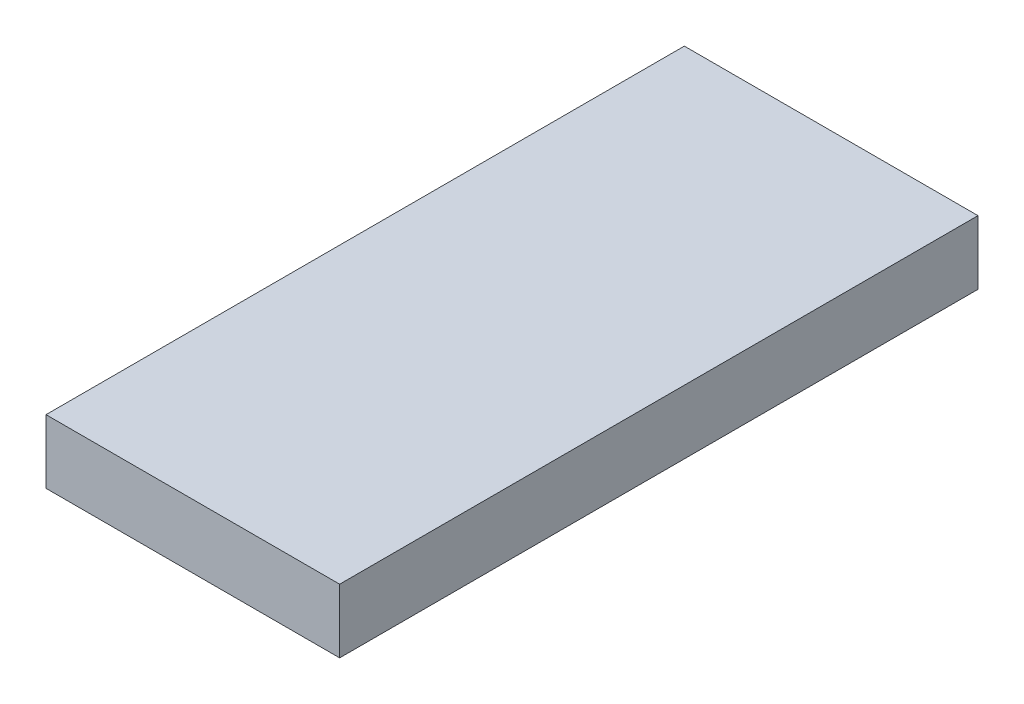
ISO-10303-21;
HEADER;
FILE_DESCRIPTION(('STEP AP214'),'2;1');
FILE_NAME('part.step','',(''),(''),'','','');
FILE_SCHEMA(('AUTOMOTIVE_DESIGN { 1 0 10303 214 1 1 1 1 }'));
ENDSEC;
DATA;
#1=APPLICATION_CONTEXT('core data for automotive mechanical design processes');
#2=APPLICATION_PROTOCOL_DEFINITION('international standard','automotive_design',2000,#1);
#3=PRODUCT_CONTEXT('',#1,'mechanical');
#4=PRODUCT('Part','Part','',(#3));
#5=PRODUCT_RELATED_PRODUCT_CATEGORY('part','',(#4));
#6=PRODUCT_DEFINITION_FORMATION('','',#4);
#7=PRODUCT_DEFINITION_CONTEXT('part definition',#1,'design');
#8=PRODUCT_DEFINITION('design','',#6,#7);
#9=PRODUCT_DEFINITION_SHAPE('','',#8);
#10=(LENGTH_UNIT() NAMED_UNIT(*) SI_UNIT(.MILLI.,.METRE.));
#11=(NAMED_UNIT(*) PLANE_ANGLE_UNIT() SI_UNIT($,.RADIAN.));
#12=(NAMED_UNIT(*) SI_UNIT($,.STERADIAN.) SOLID_ANGLE_UNIT());
#13=UNCERTAINTY_MEASURE_WITH_UNIT(LENGTH_MEASURE(1.E-05),#10,'distance_accuracy_value','');
#14=(GEOMETRIC_REPRESENTATION_CONTEXT(3) GLOBAL_UNCERTAINTY_ASSIGNED_CONTEXT((#13)) GLOBAL_UNIT_ASSIGNED_CONTEXT((#10,
#11,#12)) REPRESENTATION_CONTEXT('',''));
#15=CARTESIAN_POINT('',(0.,0.,0.));
#16=DIRECTION('',(0.,0.,1.));
#17=DIRECTION('',(1.,0.,0.));
#18=AXIS2_PLACEMENT_3D('',#15,#16,#17);
#19=CARTESIAN_POINT('',(0.,7.9375,0.));
#20=DIRECTION('',(1.,0.,0.));
#21=DIRECTION('',(0.,0.,-1.));
#22=AXIS2_PLACEMENT_3D('',#19,#20,#21);
#23=PLANE('',#22);
#24=DIRECTION('',(0.,0.,1.));
#25=VECTOR('',#24,1.);
#26=CARTESIAN_POINT('',(0.,0.,0.));
#27=LINE('',#26,#25);
#28=CARTESIAN_POINT('',(0.,0.,-79.375));
#29=VERTEX_POINT('',#28);
#30=CARTESIAN_POINT('',(0.,0.,0.));
#31=VERTEX_POINT('',#30);
#32=EDGE_CURVE('E100',#29,#31,#27,.T.);
#33=ORIENTED_EDGE('',*,*,#32,.T.);
#34=DIRECTION('',(0.,-1.,0.));
#35=VECTOR('',#34,1.);
#36=CARTESIAN_POINT('',(0.,7.9375,0.));
#37=LINE('',#36,#35);
#38=CARTESIAN_POINT('',(0.,7.9375,0.));
#39=VERTEX_POINT('',#38);
#40=EDGE_CURVE('E11',#39,#31,#37,.T.);
#41=ORIENTED_EDGE('',*,*,#40,.F.);
#42=DIRECTION('',(0.,0.,1.));
#43=VECTOR('',#42,1.);
#44=CARTESIAN_POINT('',(0.,7.9375,0.));
#45=LINE('',#44,#43);
#46=CARTESIAN_POINT('',(0.,7.9375,-79.375));
#47=VERTEX_POINT('',#46);
#48=EDGE_CURVE('E88',#47,#39,#45,.T.);
#49=ORIENTED_EDGE('',*,*,#48,.F.);
#50=DIRECTION('',(0.,-1.,0.));
#51=VECTOR('',#50,1.);
#52=CARTESIAN_POINT('',(0.,7.9375,-79.375));
#53=LINE('',#52,#51);
#54=EDGE_CURVE('E96',#47,#29,#53,.T.);
#55=ORIENTED_EDGE('',*,*,#54,.T.);
#56=EDGE_LOOP('',(#33,#41,#49,#55));
#57=FACE_BOUND('',#56,.T.);
#58=ADVANCED_FACE('F37',(#57),#23,.F.);
#59=CARTESIAN_POINT('',(0.,7.9375,0.));
#60=DIRECTION('',(0.,0.,-1.));
#61=DIRECTION('',(-1.,0.,0.));
#62=AXIS2_PLACEMENT_3D('',#59,#60,#61);
#63=PLANE('',#62);
#64=DIRECTION('',(1.,0.,0.));
#65=VECTOR('',#64,1.);
#66=CARTESIAN_POINT('',(0.,0.,0.));
#67=LINE('',#66,#65);
#68=CARTESIAN_POINT('',(36.5125,0.,0.));
#69=VERTEX_POINT('',#68);
#70=EDGE_CURVE('E92',#31,#69,#67,.T.);
#71=ORIENTED_EDGE('',*,*,#70,.T.);
#72=DIRECTION('',(0.,-1.,0.));
#73=VECTOR('',#72,1.);
#74=CARTESIAN_POINT('',(36.5125,7.9375,0.));
#75=LINE('',#74,#73);
#76=CARTESIAN_POINT('',(36.5125,7.9375,0.));
#77=VERTEX_POINT('',#76);
#78=EDGE_CURVE('E45',#77,#69,#75,.T.);
#79=ORIENTED_EDGE('',*,*,#78,.F.);
#80=DIRECTION('',(1.,0.,0.));
#81=VECTOR('',#80,1.);
#82=CARTESIAN_POINT('',(0.,7.9375,0.));
#83=LINE('',#82,#81);
#84=EDGE_CURVE('E83',#39,#77,#83,.T.);
#85=ORIENTED_EDGE('',*,*,#84,.F.);
#86=ORIENTED_EDGE('',*,*,#40,.T.);
#87=EDGE_LOOP('',(#71,#79,#85,#86));
#88=FACE_BOUND('',#87,.T.);
#89=ADVANCED_FACE('F91',(#88),#63,.F.);
#90=CARTESIAN_POINT('',(36.5125,7.9375,0.));
#91=DIRECTION('',(-1.,0.,0.));
#92=DIRECTION('',(0.,0.,1.));
#93=AXIS2_PLACEMENT_3D('',#90,#91,#92);
#94=PLANE('',#93);
#95=DIRECTION('',(0.,0.,-1.));
#96=VECTOR('',#95,1.);
#97=CARTESIAN_POINT('',(36.5125,0.,0.));
#98=LINE('',#97,#96);
#99=CARTESIAN_POINT('',(36.5125,0.,-79.375));
#100=VERTEX_POINT('',#99);
#101=EDGE_CURVE('E70',#69,#100,#98,.T.);
#102=ORIENTED_EDGE('',*,*,#101,.T.);
#103=DIRECTION('',(0.,-1.,0.));
#104=VECTOR('',#103,1.);
#105=CARTESIAN_POINT('',(36.5125,7.9375,-79.375));
#106=LINE('',#105,#104);
#107=CARTESIAN_POINT('',(36.5125,7.9375,-79.375));
#108=VERTEX_POINT('',#107);
#109=EDGE_CURVE('E93',#108,#100,#106,.T.);
#110=ORIENTED_EDGE('',*,*,#109,.F.);
#111=DIRECTION('',(0.,0.,-1.));
#112=VECTOR('',#111,1.);
#113=CARTESIAN_POINT('',(36.5125,7.9375,0.));
#114=LINE('',#113,#112);
#115=EDGE_CURVE('E86',#77,#108,#114,.T.);
#116=ORIENTED_EDGE('',*,*,#115,.F.);
#117=ORIENTED_EDGE('',*,*,#78,.T.);
#118=EDGE_LOOP('',(#102,#110,#116,#117));
#119=FACE_BOUND('',#118,.T.);
#120=ADVANCED_FACE('F94',(#119),#94,.F.);
#121=CARTESIAN_POINT('',(0.,7.9375,-79.375));
#122=DIRECTION('',(0.,0.,1.));
#123=DIRECTION('',(1.,0.,0.));
#124=AXIS2_PLACEMENT_3D('',#121,#122,#123);
#125=PLANE('',#124);
#126=DIRECTION('',(-1.,0.,0.));
#127=VECTOR('',#126,1.);
#128=CARTESIAN_POINT('',(0.,0.,-79.375));
#129=LINE('',#128,#127);
#130=EDGE_CURVE('E76',#100,#29,#129,.T.);
#131=ORIENTED_EDGE('',*,*,#130,.T.);
#132=ORIENTED_EDGE('',*,*,#54,.F.);
#133=DIRECTION('',(-1.,0.,0.));
#134=VECTOR('',#133,1.);
#135=CARTESIAN_POINT('',(0.,7.9375,-79.375));
#136=LINE('',#135,#134);
#137=EDGE_CURVE('E53',#108,#47,#136,.T.);
#138=ORIENTED_EDGE('',*,*,#137,.F.);
#139=ORIENTED_EDGE('',*,*,#109,.T.);
#140=EDGE_LOOP('',(#131,#132,#138,#139));
#141=FACE_BOUND('',#140,.T.);
#142=ADVANCED_FACE('F107',(#141),#125,.F.);
#143=CARTESIAN_POINT('',(0.,7.9375,0.));
#144=DIRECTION('',(0.,-1.,0.));
#145=DIRECTION('',(0.,0.,-1.));
#146=AXIS2_PLACEMENT_3D('',#143,#144,#145);
#147=PLANE('',#146);
#148=ORIENTED_EDGE('',*,*,#48,.T.);
#149=ORIENTED_EDGE('',*,*,#84,.T.);
#150=ORIENTED_EDGE('',*,*,#115,.T.);
#151=ORIENTED_EDGE('',*,*,#137,.T.);
#152=EDGE_LOOP('',(#148,#149,#150,#151));
#153=FACE_BOUND('',#152,.T.);
#154=ADVANCED_FACE('F84',(#153),#147,.F.);
#155=CARTESIAN_POINT('',(0.,0.,0.));
#156=DIRECTION('',(0.,-1.,0.));
#157=DIRECTION('',(0.,0.,-1.));
#158=AXIS2_PLACEMENT_3D('',#155,#156,#157);
#159=PLANE('',#158);
#160=ORIENTED_EDGE('',*,*,#32,.F.);
#161=ORIENTED_EDGE('',*,*,#130,.F.);
#162=ORIENTED_EDGE('',*,*,#101,.F.);
#163=ORIENTED_EDGE('',*,*,#70,.F.);
#164=EDGE_LOOP('',(#160,#161,#162,#163));
#165=FACE_BOUND('',#164,.T.);
#166=ADVANCED_FACE('F110',(#165),#159,.T.);
#167=CLOSED_SHELL('',(#58,#89,#120,#142,#154,#166));
#168=MANIFOLD_SOLID_BREP('B2',#167);
#169=ADVANCED_BREP_SHAPE_REPRESENTATION('',(#18,#168),#14);
#170=SHAPE_DEFINITION_REPRESENTATION(#9,#169);
ENDSEC;
END-ISO-10303-21;
